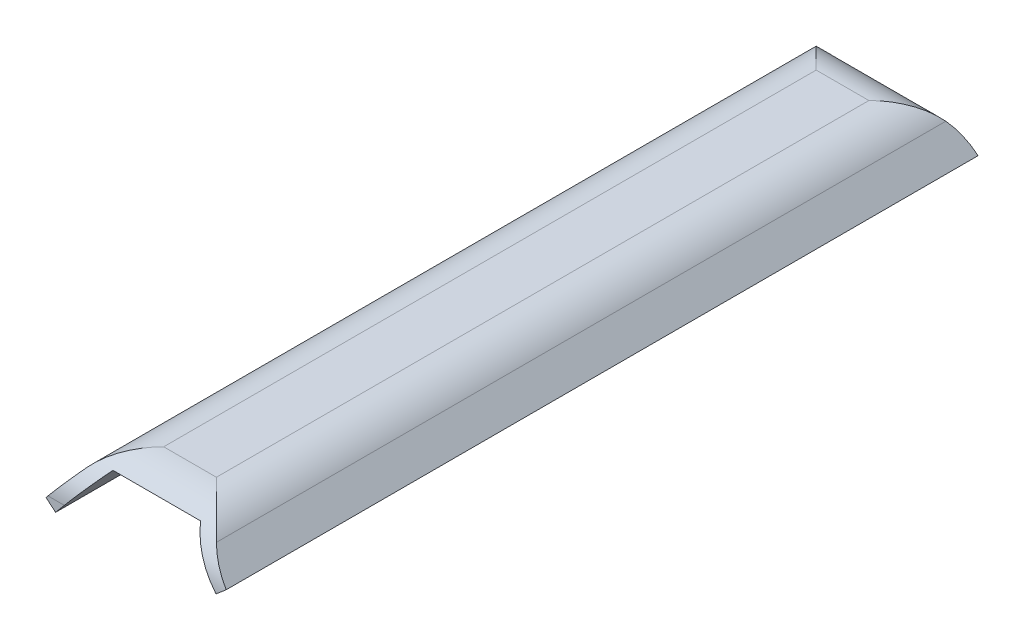
ISO-10303-21;
HEADER;
FILE_DESCRIPTION(('STEP AP214'),'2;1');
FILE_NAME('part.step','',(''),(''),'','','');
FILE_SCHEMA(('AUTOMOTIVE_DESIGN { 1 0 10303 214 1 1 1 1 }'));
ENDSEC;
DATA;
#1=APPLICATION_CONTEXT('core data for automotive mechanical design processes');
#2=APPLICATION_PROTOCOL_DEFINITION('international standard','automotive_design',2000,#1);
#3=PRODUCT_CONTEXT('',#1,'mechanical');
#4=PRODUCT('Part','Part','',(#3));
#5=PRODUCT_RELATED_PRODUCT_CATEGORY('part','',(#4));
#6=PRODUCT_DEFINITION_FORMATION('','',#4);
#7=PRODUCT_DEFINITION_CONTEXT('part definition',#1,'design');
#8=PRODUCT_DEFINITION('design','',#6,#7);
#9=PRODUCT_DEFINITION_SHAPE('','',#8);
#10=(LENGTH_UNIT() NAMED_UNIT(*) SI_UNIT(.MILLI.,.METRE.));
#11=(NAMED_UNIT(*) PLANE_ANGLE_UNIT() SI_UNIT($,.RADIAN.));
#12=(NAMED_UNIT(*) SI_UNIT($,.STERADIAN.) SOLID_ANGLE_UNIT());
#13=UNCERTAINTY_MEASURE_WITH_UNIT(LENGTH_MEASURE(1.E-05),#10,'distance_accuracy_value','');
#14=(GEOMETRIC_REPRESENTATION_CONTEXT(3) GLOBAL_UNCERTAINTY_ASSIGNED_CONTEXT((#13)) GLOBAL_UNIT_ASSIGNED_CONTEXT((#10,
#11,#12)) REPRESENTATION_CONTEXT('',''));
#15=CARTESIAN_POINT('',(0.,0.,0.));
#16=DIRECTION('',(0.,0.,1.));
#17=DIRECTION('',(1.,0.,0.));
#18=AXIS2_PLACEMENT_3D('',#15,#16,#17);
#19=CARTESIAN_POINT('',(0.,0.,0.));
#20=DIRECTION('',(0.,0.,-1.));
#21=DIRECTION('',(-1.,0.,0.));
#22=AXIS2_PLACEMENT_3D('',#19,#20,#21);
#23=PLANE('',#22);
#24=DIRECTION('',(-0.642787609686543,-0.766044443118975,0.));
#25=VECTOR('',#24,1.);
#26=CARTESIAN_POINT('',(-7.66044443118975,6.42787609686543,0.));
#27=LINE('',#26,#25);
#28=CARTESIAN_POINT('',(-38.2270618286415,-30.,0.));
#29=VERTEX_POINT('',#28);
#30=CARTESIAN_POINT('',(-39.7998249155169,-31.8743460590833,0.));
#31=VERTEX_POINT('',#30);
#32=EDGE_CURVE('E150',#29,#31,#27,.T.);
#33=ORIENTED_EDGE('',*,*,#32,.F.);
#34=DIRECTION('',(-1.,0.,0.));
#35=VECTOR('',#34,1.);
#36=CARTESIAN_POINT('',(74.66307658155,-30.,0.));
#37=LINE('',#36,#35);
#38=CARTESIAN_POINT('',(-25.1729889353186,-30.,0.));
#39=VERTEX_POINT('',#38);
#40=EDGE_CURVE('E11',#29,#39,#37,.F.);
#41=ORIENTED_EDGE('',*,*,#40,.T.);
#42=DIRECTION('',(-0.642787609686543,-0.766044443118975,0.));
#43=VECTOR('',#42,1.);
#44=CARTESIAN_POINT('',(0.,0.,0.));
#45=LINE('',#44,#43);
#46=CARTESIAN_POINT('',(-32.1393804843271,-38.3022221559487,0.));
#47=VERTEX_POINT('',#46);
#48=EDGE_CURVE('E173',#39,#47,#45,.T.);
#49=ORIENTED_EDGE('',*,*,#48,.T.);
#50=DIRECTION('',(-0.766044443118975,0.642787609686543,0.));
#51=VECTOR('',#50,1.);
#52=CARTESIAN_POINT('',(-32.1393804843271,-38.3022221559487,0.));
#53=LINE('',#52,#51);
#54=EDGE_CURVE('E171',#47,#31,#53,.T.);
#55=ORIENTED_EDGE('',*,*,#54,.T.);
#56=EDGE_LOOP('',(#33,#41,#49,#55));
#57=FACE_BOUND('',#56,.T.);
#58=ADVANCED_FACE('F34',(#57),#23,.T.);
#59=CARTESIAN_POINT('',(0.,0.,600.));
#60=DIRECTION('',(0.,0.,-1.));
#61=DIRECTION('',(-1.,0.,0.));
#62=AXIS2_PLACEMENT_3D('',#59,#60,#61);
#63=PLANE('',#62);
#64=DIRECTION('',(-0.76604444311898,-0.642787609686537,0.));
#65=VECTOR('',#64,1.);
#66=CARTESIAN_POINT('',(103.371948818651,-24.2139016278938,600.));
#67=LINE('',#66,#65);
#68=CARTESIAN_POINT('',(96.4763452965902,-30.,600.));
#69=VERTEX_POINT('',#68);
#70=CARTESIAN_POINT('',(95.7115043874615,-30.6417777247592,600.));
#71=VERTEX_POINT('',#70);
#72=EDGE_CURVE('E167',#69,#71,#67,.T.);
#73=ORIENTED_EDGE('',*,*,#72,.F.);
#74=DIRECTION('',(-1.,0.,0.));
#75=VECTOR('',#74,1.);
#76=CARTESIAN_POINT('',(0.,-30.,600.));
#77=LINE('',#76,#75);
#78=CARTESIAN_POINT('',(95.1729889353183,-30.,600.));
#79=VERTEX_POINT('',#78);
#80=EDGE_CURVE('E206',#69,#79,#77,.T.);
#81=ORIENTED_EDGE('',*,*,#80,.T.);
#82=DIRECTION('',(-0.642787609686537,0.76604444311898,0.));
#83=VECTOR('',#82,1.);
#84=CARTESIAN_POINT('',(70.,0.,600.));
#85=LINE('',#84,#83);
#86=EDGE_CURVE('E162',#71,#79,#85,.T.);
#87=ORIENTED_EDGE('',*,*,#86,.F.);
#88=EDGE_LOOP('',(#73,#81,#87));
#89=FACE_BOUND('',#88,.T.);
#90=ADVANCED_FACE('F272',(#89),#63,.F.);
#91=CARTESIAN_POINT('',(-7.66044443118975,6.42787609686543,600.));
#92=DIRECTION('',(0.766044443118975,-0.642787609686543,0.));
#93=DIRECTION('',(0.642787609686543,0.766044443118975,0.));
#94=AXIS2_PLACEMENT_3D('',#91,#92,#93);
#95=PLANE('',#94);
#96=DIRECTION('',(-0.642787609686543,-0.766044443118975,0.));
#97=VECTOR('',#96,1.);
#98=CARTESIAN_POINT('',(-7.66044443118975,6.42787609686543,600.));
#99=LINE('',#98,#97);
#100=CARTESIAN_POINT('',(-38.2270618286415,-30.,600.));
#101=VERTEX_POINT('',#100);
#102=CARTESIAN_POINT('',(-39.7998249155169,-31.8743460590833,600.));
#103=VERTEX_POINT('',#102);
#104=EDGE_CURVE('E136',#101,#103,#99,.T.);
#105=ORIENTED_EDGE('',*,*,#104,.F.);
#106=CARTESIAN_POINT('',(-38.2270618286415,-30.,560.));
#107=DIRECTION('',(0.766044443118975,-0.642787609686543,0.));
#108=DIRECTION('',(-0.642787609686543,-0.766044443118975,0.));
#109=AXIS2_PLACEMENT_3D('',#106,#107,#108);
#110=ELLIPSE('',#109,52.2162915732914,40.);
#111=CARTESIAN_POINT('',(-16.6525479801091,-4.28849561253828,590.641777724759));
#112=VERTEX_POINT('',#111);
#113=EDGE_CURVE('E58',#101,#112,#110,.F.);
#114=ORIENTED_EDGE('',*,*,#113,.T.);
#115=DIRECTION('',(0.,0.,-1.));
#116=VECTOR('',#115,1.);
#117=CARTESIAN_POINT('',(-16.6525479801091,-4.28849561253828,600.));
#118=LINE('',#117,#116);
#119=CARTESIAN_POINT('',(-16.6525479801091,-4.28849561253828,9.35822227524108));
#120=VERTEX_POINT('',#119);
#121=EDGE_CURVE('E222',#112,#120,#118,.T.);
#122=ORIENTED_EDGE('',*,*,#121,.T.);
#123=CARTESIAN_POINT('',(-38.2270618286415,-30.,40.));
#124=DIRECTION('',(0.766044443118975,-0.642787609686543,0.));
#125=DIRECTION('',(0.642787609686543,0.766044443118975,0.));
#126=AXIS2_PLACEMENT_3D('',#123,#124,#125);
#127=ELLIPSE('',#126,52.2162915732914,40.);
#128=EDGE_CURVE('E220',#120,#29,#127,.F.);
#129=ORIENTED_EDGE('',*,*,#128,.T.);
#130=ORIENTED_EDGE('',*,*,#32,.T.);
#131=DIRECTION('',(0.,0.,-1.));
#132=VECTOR('',#131,1.);
#133=CARTESIAN_POINT('',(-39.7998249155169,-31.8743460590833,600.));
#134=LINE('',#133,#132);
#135=EDGE_CURVE('E147',#103,#31,#134,.T.);
#136=ORIENTED_EDGE('',*,*,#135,.F.);
#137=EDGE_LOOP('',(#105,#114,#122,#129,#130,#136));
#138=FACE_BOUND('',#137,.T.);
#139=ADVANCED_FACE('F148',(#138),#95,.F.);
#140=CARTESIAN_POINT('',(-32.1393804843271,-38.3022221559487,600.));
#141=DIRECTION('',(-0.642787609686543,-0.766044443118975,0.));
#142=DIRECTION('',(0.766044443118975,-0.642787609686543,0.));
#143=AXIS2_PLACEMENT_3D('',#140,#141,#142);
#144=PLANE('',#143);
#145=ORIENTED_EDGE('',*,*,#54,.F.);
#146=DIRECTION('',(0.,0.,-1.));
#147=VECTOR('',#146,1.);
#148=CARTESIAN_POINT('',(-32.1393804843271,-38.3022221559487,600.));
#149=LINE('',#148,#147);
#150=CARTESIAN_POINT('',(-32.1393804843271,-38.3022221559487,600.));
#151=VERTEX_POINT('',#150);
#152=EDGE_CURVE('E155',#151,#47,#149,.T.);
#153=ORIENTED_EDGE('',*,*,#152,.F.);
#154=DIRECTION('',(-0.766044443118975,0.642787609686543,0.));
#155=VECTOR('',#154,1.);
#156=CARTESIAN_POINT('',(-32.1393804843271,-38.3022221559487,600.));
#157=LINE('',#156,#155);
#158=EDGE_CURVE('E141',#151,#103,#157,.T.);
#159=ORIENTED_EDGE('',*,*,#158,.T.);
#160=ORIENTED_EDGE('',*,*,#135,.T.);
#161=EDGE_LOOP('',(#145,#153,#159,#160));
#162=FACE_BOUND('',#161,.T.);
#163=ADVANCED_FACE('F158',(#162),#144,.T.);
#164=CARTESIAN_POINT('',(0.,0.,600.));
#165=DIRECTION('',(0.766044443118975,-0.642787609686543,0.));
#166=DIRECTION('',(0.642787609686543,0.766044443118975,0.));
#167=AXIS2_PLACEMENT_3D('',#164,#165,#166);
#168=PLANE('',#167);
#169=DIRECTION('',(0.,0.,-1.));
#170=VECTOR('',#169,1.);
#171=CARTESIAN_POINT('',(0.,0.,600.));
#172=LINE('',#171,#170);
#173=CARTESIAN_POINT('',(0.,0.,586.457513110646));
#174=VERTEX_POINT('',#173);
#175=CARTESIAN_POINT('',(0.,0.,13.5424868893541));
#176=VERTEX_POINT('',#175);
#177=EDGE_CURVE('E186',#174,#176,#172,.T.);
#178=ORIENTED_EDGE('',*,*,#177,.F.);
#179=CARTESIAN_POINT('',(-25.1729889353186,-30.,560.));
#180=DIRECTION('',(0.766044443118975,-0.642787609686543,0.));
#181=DIRECTION('',(-0.642787609686543,-0.766044443118975,0.));
#182=AXIS2_PLACEMENT_3D('',#179,#180,#181);
#183=ELLIPSE('',#182,52.2162915732914,40.);
#184=CARTESIAN_POINT('',(-25.1729889353186,-30.,600.));
#185=VERTEX_POINT('',#184);
#186=EDGE_CURVE('E218',#174,#185,#183,.T.);
#187=ORIENTED_EDGE('',*,*,#186,.T.);
#188=DIRECTION('',(-0.642787609686543,-0.766044443118975,0.));
#189=VECTOR('',#188,1.);
#190=CARTESIAN_POINT('',(0.,0.,600.));
#191=LINE('',#190,#189);
#192=EDGE_CURVE('E160',#185,#151,#191,.T.);
#193=ORIENTED_EDGE('',*,*,#192,.T.);
#194=ORIENTED_EDGE('',*,*,#152,.T.);
#195=ORIENTED_EDGE('',*,*,#48,.F.);
#196=CARTESIAN_POINT('',(-25.1729889353186,-30.,40.));
#197=DIRECTION('',(0.766044443118975,-0.642787609686543,0.));
#198=DIRECTION('',(0.642787609686543,0.766044443118975,0.));
#199=AXIS2_PLACEMENT_3D('',#196,#197,#198);
#200=ELLIPSE('',#199,52.2162915732914,40.);
#201=EDGE_CURVE('E216',#39,#176,#200,.T.);
#202=ORIENTED_EDGE('',*,*,#201,.T.);
#203=EDGE_LOOP('',(#178,#187,#193,#194,#195,#202));
#204=FACE_BOUND('',#203,.T.);
#205=ADVANCED_FACE('F257',(#204),#168,.T.);
#206=CARTESIAN_POINT('',(0.,0.,600.));
#207=DIRECTION('',(0.,-1.,0.));
#208=DIRECTION('',(0.,0.,-1.));
#209=AXIS2_PLACEMENT_3D('',#206,#207,#208);
#210=PLANE('',#209);
#211=DIRECTION('',(0.,0.,-1.));
#212=VECTOR('',#211,1.);
#213=CARTESIAN_POINT('',(70.,0.,600.));
#214=LINE('',#213,#212);
#215=CARTESIAN_POINT('',(70.,0.,586.457513110646));
#216=VERTEX_POINT('',#215);
#217=CARTESIAN_POINT('',(70.,0.,13.5424868893541));
#218=VERTEX_POINT('',#217);
#219=EDGE_CURVE('E183',#216,#218,#214,.T.);
#220=ORIENTED_EDGE('',*,*,#219,.F.);
#221=DIRECTION('',(-1.,0.,0.));
#222=VECTOR('',#221,1.);
#223=CARTESIAN_POINT('',(70.,0.,586.457513110646));
#224=LINE('',#223,#222);
#225=EDGE_CURVE('E214',#216,#174,#224,.T.);
#226=ORIENTED_EDGE('',*,*,#225,.T.);
#227=ORIENTED_EDGE('',*,*,#177,.T.);
#228=DIRECTION('',(1.,0.,0.));
#229=VECTOR('',#228,1.);
#230=CARTESIAN_POINT('',(0.,0.,13.5424868893541));
#231=LINE('',#230,#229);
#232=EDGE_CURVE('E212',#176,#218,#231,.T.);
#233=ORIENTED_EDGE('',*,*,#232,.T.);
#234=EDGE_LOOP('',(#220,#226,#227,#233));
#235=FACE_BOUND('',#234,.T.);
#236=ADVANCED_FACE('F261',(#235),#210,.T.);
#237=CARTESIAN_POINT('',(70.,0.,600.));
#238=DIRECTION('',(-0.76604444311898,-0.642787609686537,0.));
#239=DIRECTION('',(0.642787609686537,-0.76604444311898,0.));
#240=AXIS2_PLACEMENT_3D('',#237,#238,#239);
#241=PLANE('',#240);
#242=ORIENTED_EDGE('',*,*,#86,.T.);
#243=CARTESIAN_POINT('',(95.1729889353183,-30.,560.));
#244=DIRECTION('',(-0.76604444311898,-0.642787609686537,0.));
#245=DIRECTION('',(-0.642787609686537,0.76604444311898,0.));
#246=AXIS2_PLACEMENT_3D('',#243,#244,#245);
#247=ELLIPSE('',#246,52.216291573291,40.);
#248=EDGE_CURVE('E210',#79,#216,#247,.T.);
#249=ORIENTED_EDGE('',*,*,#248,.T.);
#250=ORIENTED_EDGE('',*,*,#219,.T.);
#251=CARTESIAN_POINT('',(95.1729889353183,-30.,40.));
#252=DIRECTION('',(-0.76604444311898,-0.642787609686537,0.));
#253=DIRECTION('',(0.642787609686537,-0.76604444311898,0.));
#254=AXIS2_PLACEMENT_3D('',#251,#252,#253);
#255=ELLIPSE('',#254,52.216291573291,40.);
#256=CARTESIAN_POINT('',(95.1729889353183,-30.,0.));
#257=VERTEX_POINT('',#256);
#258=EDGE_CURVE('E208',#218,#257,#255,.T.);
#259=ORIENTED_EDGE('',*,*,#258,.T.);
#260=DIRECTION('',(-0.642787609686537,0.76604444311898,0.));
#261=VECTOR('',#260,1.);
#262=CARTESIAN_POINT('',(70.,0.,0.));
#263=LINE('',#262,#261);
#264=CARTESIAN_POINT('',(95.7115043874615,-30.6417777247592,0.));
#265=VERTEX_POINT('',#264);
#266=EDGE_CURVE('E175',#265,#257,#263,.T.);
#267=ORIENTED_EDGE('',*,*,#266,.F.);
#268=DIRECTION('',(0.,0.,-1.));
#269=VECTOR('',#268,1.);
#270=CARTESIAN_POINT('',(95.7115043874615,-30.6417777247592,600.));
#271=LINE('',#270,#269);
#272=EDGE_CURVE('E180',#71,#265,#271,.T.);
#273=ORIENTED_EDGE('',*,*,#272,.F.);
#274=EDGE_LOOP('',(#242,#249,#250,#259,#267,#273));
#275=FACE_BOUND('',#274,.T.);
#276=ADVANCED_FACE('F266',(#275),#241,.T.);
#277=CARTESIAN_POINT('',(103.371948818651,-24.2139016278938,600.));
#278=DIRECTION('',(0.642787609686537,-0.76604444311898,0.));
#279=DIRECTION('',(0.76604444311898,0.642787609686537,0.));
#280=AXIS2_PLACEMENT_3D('',#277,#278,#279);
#281=PLANE('',#280);
#282=DIRECTION('',(0.,0.,-1.));
#283=VECTOR('',#282,1.);
#284=CARTESIAN_POINT('',(103.371948818651,-24.2139016278938,600.));
#285=LINE('',#284,#283);
#286=CARTESIAN_POINT('',(103.371948818651,-24.2139016278938,599.579300974478));
#287=VERTEX_POINT('',#286);
#288=CARTESIAN_POINT('',(103.371948818651,-24.2139016278938,0.420699025522109));
#289=VERTEX_POINT('',#288);
#290=EDGE_CURVE('E169',#287,#289,#285,.T.);
#291=ORIENTED_EDGE('',*,*,#290,.F.);
#292=CARTESIAN_POINT('',(96.4763452965902,-30.,560.));
#293=DIRECTION('',(0.642787609686537,-0.76604444311898,0.));
#294=DIRECTION('',(-0.76604444311898,-0.642787609686537,0.));
#295=AXIS2_PLACEMENT_3D('',#292,#293,#294);
#296=ELLIPSE('',#295,62.2289530744167,40.);
#297=EDGE_CURVE('E227',#287,#69,#296,.T.);
#298=ORIENTED_EDGE('',*,*,#297,.T.);
#299=ORIENTED_EDGE('',*,*,#72,.T.);
#300=ORIENTED_EDGE('',*,*,#272,.T.);
#301=DIRECTION('',(-0.76604444311898,-0.642787609686537,0.));
#302=VECTOR('',#301,1.);
#303=CARTESIAN_POINT('',(103.371948818651,-24.2139016278938,0.));
#304=LINE('',#303,#302);
#305=CARTESIAN_POINT('',(96.4763452965902,-30.,0.));
#306=VERTEX_POINT('',#305);
#307=EDGE_CURVE('E144',#306,#265,#304,.T.);
#308=ORIENTED_EDGE('',*,*,#307,.F.);
#309=CARTESIAN_POINT('',(96.4763452965902,-30.,40.));
#310=DIRECTION('',(0.642787609686537,-0.76604444311898,0.));
#311=DIRECTION('',(0.76604444311898,0.642787609686537,0.));
#312=AXIS2_PLACEMENT_3D('',#309,#310,#311);
#313=ELLIPSE('',#312,62.2289530744167,40.);
#314=EDGE_CURVE('E225',#306,#289,#313,.T.);
#315=ORIENTED_EDGE('',*,*,#314,.T.);
#316=EDGE_LOOP('',(#291,#298,#299,#300,#308,#315));
#317=FACE_BOUND('',#316,.T.);
#318=ADVANCED_FACE('F275',(#317),#281,.T.);
#319=CARTESIAN_POINT('',(77.6604444311898,6.42787609686537,600.));
#320=DIRECTION('',(-0.76604444311898,-0.642787609686537,0.));
#321=DIRECTION('',(0.642787609686537,-0.76604444311898,0.));
#322=AXIS2_PLACEMENT_3D('',#319,#320,#321);
#323=PLANE('',#322);
#324=DIRECTION('',(0.,0.,-1.));
#325=VECTOR('',#324,1.);
#326=CARTESIAN_POINT('',(86.6525479801092,-4.2884956125385,600.));
#327=LINE('',#326,#325);
#328=CARTESIAN_POINT('',(86.6525479801092,-4.2884956125385,9.35822227524086));
#329=VERTEX_POINT('',#328);
#330=CARTESIAN_POINT('',(86.6525479801092,-4.2884956125385,590.641777724759));
#331=VERTEX_POINT('',#330);
#332=EDGE_CURVE('E200',#329,#331,#327,.F.);
#333=ORIENTED_EDGE('',*,*,#332,.T.);
#334=CARTESIAN_POINT('',(108.227061828641,-30.,560.));
#335=DIRECTION('',(-0.76604444311898,-0.642787609686537,0.));
#336=DIRECTION('',(-0.642787609686537,0.76604444311898,0.));
#337=AXIS2_PLACEMENT_3D('',#334,#335,#336);
#338=ELLIPSE('',#337,52.216291573291,40.);
#339=EDGE_CURVE('E203',#331,#287,#338,.F.);
#340=ORIENTED_EDGE('',*,*,#339,.T.);
#341=ORIENTED_EDGE('',*,*,#290,.T.);
#342=CARTESIAN_POINT('',(108.227061828641,-30.,40.));
#343=DIRECTION('',(-0.76604444311898,-0.642787609686537,0.));
#344=DIRECTION('',(0.642787609686537,-0.76604444311898,0.));
#345=AXIS2_PLACEMENT_3D('',#342,#343,#344);
#346=ELLIPSE('',#345,52.216291573291,40.);
#347=EDGE_CURVE('E198',#289,#329,#346,.F.);
#348=ORIENTED_EDGE('',*,*,#347,.T.);
#349=EDGE_LOOP('',(#333,#340,#341,#348));
#350=FACE_BOUND('',#349,.T.);
#351=ADVANCED_FACE('F280',(#350),#323,.F.);
#352=CARTESIAN_POINT('',(0.,10.,600.));
#353=DIRECTION('',(0.,-1.,0.));
#354=DIRECTION('',(0.,0.,-1.));
#355=AXIS2_PLACEMENT_3D('',#352,#353,#354);
#356=PLANE('',#355);
#357=DIRECTION('',(-1.,0.,0.));
#358=VECTOR('',#357,1.);
#359=CARTESIAN_POINT('',(0.,10.,560.));
#360=LINE('',#359,#358);
#361=CARTESIAN_POINT('',(13.9892297446499,10.,560.));
#362=VERTEX_POINT('',#361);
#363=CARTESIAN_POINT('',(56.01077025535,10.,560.));
#364=VERTEX_POINT('',#363);
#365=EDGE_CURVE('E193',#362,#364,#360,.F.);
#366=ORIENTED_EDGE('',*,*,#365,.T.);
#367=DIRECTION('',(0.,0.,-1.));
#368=VECTOR('',#367,1.);
#369=CARTESIAN_POINT('',(56.01077025535,10.,600.));
#370=LINE('',#369,#368);
#371=CARTESIAN_POINT('',(56.01077025535,10.,40.));
#372=VERTEX_POINT('',#371);
#373=EDGE_CURVE('E195',#364,#372,#370,.T.);
#374=ORIENTED_EDGE('',*,*,#373,.T.);
#375=DIRECTION('',(-1.,0.,0.));
#376=VECTOR('',#375,1.);
#377=CARTESIAN_POINT('',(-4.66307658154996,10.,40.));
#378=LINE('',#377,#376);
#379=CARTESIAN_POINT('',(13.9892297446499,10.,40.));
#380=VERTEX_POINT('',#379);
#381=EDGE_CURVE('E154',#372,#380,#378,.T.);
#382=ORIENTED_EDGE('',*,*,#381,.T.);
#383=DIRECTION('',(0.,0.,-1.));
#384=VECTOR('',#383,1.);
#385=CARTESIAN_POINT('',(13.9892297446499,10.,600.));
#386=LINE('',#385,#384);
#387=EDGE_CURVE('E191',#380,#362,#386,.F.);
#388=ORIENTED_EDGE('',*,*,#387,.T.);
#389=EDGE_LOOP('',(#366,#374,#382,#388));
#390=FACE_BOUND('',#389,.T.);
#391=ADVANCED_FACE('F287',(#390),#356,.F.);
#392=ORIENTED_EDGE('',*,*,#192,.F.);
#393=DIRECTION('',(-1.,0.,0.));
#394=VECTOR('',#393,1.);
#395=CARTESIAN_POINT('',(0.,-30.,600.));
#396=LINE('',#395,#394);
#397=EDGE_CURVE('E143',#185,#101,#396,.T.);
#398=ORIENTED_EDGE('',*,*,#397,.T.);
#399=ORIENTED_EDGE('',*,*,#104,.T.);
#400=ORIENTED_EDGE('',*,*,#158,.F.);
#401=EDGE_LOOP('',(#392,#398,#399,#400));
#402=FACE_BOUND('',#401,.T.);
#403=ADVANCED_FACE('F139',(#402),#63,.F.);
#404=ORIENTED_EDGE('',*,*,#266,.T.);
#405=DIRECTION('',(-1.,0.,0.));
#406=VECTOR('',#405,1.);
#407=CARTESIAN_POINT('',(74.66307658155,-30.,0.));
#408=LINE('',#407,#406);
#409=EDGE_CURVE('E43',#257,#306,#408,.F.);
#410=ORIENTED_EDGE('',*,*,#409,.T.);
#411=ORIENTED_EDGE('',*,*,#307,.T.);
#412=EDGE_LOOP('',(#404,#410,#411));
#413=FACE_BOUND('',#412,.T.);
#414=ADVANCED_FACE('F294',(#413),#23,.T.);
#415=CARTESIAN_POINT('',(13.9892297446499,-30.,600.));
#416=DIRECTION('',(0.,0.,-1.));
#417=DIRECTION('',(-1.,0.,0.));
#418=AXIS2_PLACEMENT_3D('',#415,#416,#417);
#419=CYLINDRICAL_SURFACE('',#418,40.);
#420=CARTESIAN_POINT('',(13.9892297446499,-30.,40.));
#421=DIRECTION('',(0.707106781186547,0.,-0.707106781186547));
#422=DIRECTION('',(0.707106781186547,0.,0.707106781186547));
#423=AXIS2_PLACEMENT_3D('',#420,#421,#422);
#424=ELLIPSE('',#423,56.5685424949238,40.);
#425=EDGE_CURVE('E233',#120,#380,#424,.T.);
#426=ORIENTED_EDGE('',*,*,#425,.F.);
#427=ORIENTED_EDGE('',*,*,#121,.F.);
#428=CARTESIAN_POINT('',(13.9892297446499,-30.,560.));
#429=DIRECTION('',(-0.707106781186547,0.,-0.707106781186547));
#430=DIRECTION('',(0.707106781186547,0.,-0.707106781186547));
#431=AXIS2_PLACEMENT_3D('',#428,#429,#430);
#432=ELLIPSE('',#431,56.5685424949238,40.);
#433=EDGE_CURVE('E38',#362,#112,#432,.F.);
#434=ORIENTED_EDGE('',*,*,#433,.F.);
#435=ORIENTED_EDGE('',*,*,#387,.F.);
#436=EDGE_LOOP('',(#426,#427,#434,#435));
#437=FACE_BOUND('',#436,.T.);
#438=ADVANCED_FACE('F36',(#437),#419,.T.);
#439=CARTESIAN_POINT('',(0.,-30.,560.));
#440=DIRECTION('',(-1.,0.,0.));
#441=DIRECTION('',(0.,0.,1.));
#442=AXIS2_PLACEMENT_3D('',#439,#440,#441);
#443=CYLINDRICAL_SURFACE('',#442,40.);
#444=ORIENTED_EDGE('',*,*,#297,.F.);
#445=ORIENTED_EDGE('',*,*,#339,.F.);
#446=CARTESIAN_POINT('',(56.01077025535,-30.,560.));
#447=DIRECTION('',(-0.707106781186548,0.,0.707106781186547));
#448=DIRECTION('',(-0.707106781186548,0.,-0.707106781186547));
#449=AXIS2_PLACEMENT_3D('',#446,#447,#448);
#450=ELLIPSE('',#449,56.5685424949238,40.);
#451=EDGE_CURVE('E232',#364,#331,#450,.F.);
#452=ORIENTED_EDGE('',*,*,#451,.F.);
#453=ORIENTED_EDGE('',*,*,#365,.F.);
#454=ORIENTED_EDGE('',*,*,#433,.T.);
#455=ORIENTED_EDGE('',*,*,#113,.F.);
#456=ORIENTED_EDGE('',*,*,#397,.F.);
#457=ORIENTED_EDGE('',*,*,#186,.F.);
#458=ORIENTED_EDGE('',*,*,#225,.F.);
#459=ORIENTED_EDGE('',*,*,#248,.F.);
#460=ORIENTED_EDGE('',*,*,#80,.F.);
#461=EDGE_LOOP('',(#444,#445,#452,#453,#454,#455,#456,#457,#458,#459,#460));
#462=FACE_BOUND('',#461,.T.);
#463=ADVANCED_FACE('F244',(#462),#443,.T.);
#464=CARTESIAN_POINT('',(0.,-30.,40.));
#465=DIRECTION('',(1.,0.,0.));
#466=DIRECTION('',(0.,0.,-1.));
#467=AXIS2_PLACEMENT_3D('',#464,#465,#466);
#468=CYLINDRICAL_SURFACE('',#467,40.);
#469=ORIENTED_EDGE('',*,*,#425,.T.);
#470=ORIENTED_EDGE('',*,*,#381,.F.);
#471=CARTESIAN_POINT('',(56.01077025535,-30.,40.0000000000001));
#472=DIRECTION('',(0.707106781186548,0.,0.707106781186547));
#473=DIRECTION('',(0.707106781186548,0.,-0.707106781186547));
#474=AXIS2_PLACEMENT_3D('',#471,#472,#473);
#475=ELLIPSE('',#474,56.5685424949238,40.);
#476=EDGE_CURVE('E230',#329,#372,#475,.T.);
#477=ORIENTED_EDGE('',*,*,#476,.F.);
#478=ORIENTED_EDGE('',*,*,#347,.F.);
#479=ORIENTED_EDGE('',*,*,#314,.F.);
#480=ORIENTED_EDGE('',*,*,#409,.F.);
#481=ORIENTED_EDGE('',*,*,#258,.F.);
#482=ORIENTED_EDGE('',*,*,#232,.F.);
#483=ORIENTED_EDGE('',*,*,#201,.F.);
#484=ORIENTED_EDGE('',*,*,#40,.F.);
#485=ORIENTED_EDGE('',*,*,#128,.F.);
#486=EDGE_LOOP('',(#469,#470,#477,#478,#479,#480,#481,#482,#483,#484,#485));
#487=FACE_BOUND('',#486,.T.);
#488=ADVANCED_FACE('F252',(#487),#468,.T.);
#489=CARTESIAN_POINT('',(56.01077025535,-30.,600.));
#490=DIRECTION('',(0.,0.,-1.));
#491=DIRECTION('',(-1.,0.,0.));
#492=AXIS2_PLACEMENT_3D('',#489,#490,#491);
#493=CYLINDRICAL_SURFACE('',#492,40.);
#494=ORIENTED_EDGE('',*,*,#451,.T.);
#495=ORIENTED_EDGE('',*,*,#332,.F.);
#496=ORIENTED_EDGE('',*,*,#476,.T.);
#497=ORIENTED_EDGE('',*,*,#373,.F.);
#498=EDGE_LOOP('',(#494,#495,#496,#497));
#499=FACE_BOUND('',#498,.T.);
#500=ADVANCED_FACE('F284',(#499),#493,.T.);
#501=CLOSED_SHELL('',(#58,#90,#139,#163,#205,#236,#276,#318,#351,#391,#403,#414,#438,#463,#488,#500));
#502=MANIFOLD_SOLID_BREP('B2',#501);
#503=ADVANCED_BREP_SHAPE_REPRESENTATION('',(#18,#502),#14);
#504=SHAPE_DEFINITION_REPRESENTATION(#9,#503);
ENDSEC;
END-ISO-10303-21;
